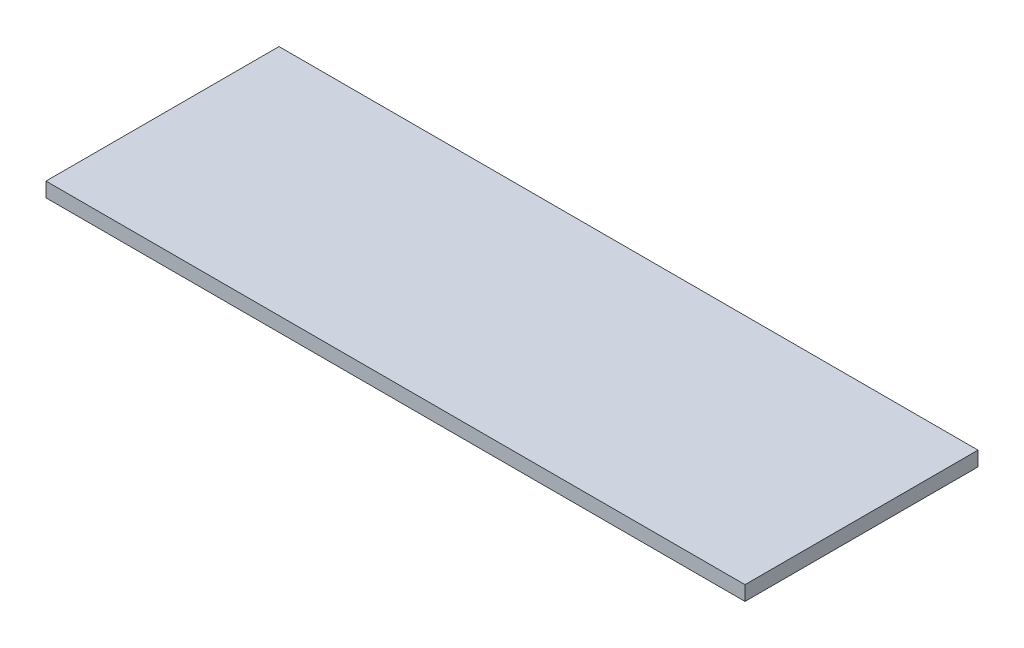
ISO-10303-21;
HEADER;
FILE_DESCRIPTION(('STEP AP214'),'2;1');
FILE_NAME('part.step','',(''),(''),'','','');
FILE_SCHEMA(('AUTOMOTIVE_DESIGN { 1 0 10303 214 1 1 1 1 }'));
ENDSEC;
DATA;
#1=APPLICATION_CONTEXT('core data for automotive mechanical design processes');
#2=APPLICATION_PROTOCOL_DEFINITION('international standard','automotive_design',2000,#1);
#3=PRODUCT_CONTEXT('',#1,'mechanical');
#4=PRODUCT('Part','Part','',(#3));
#5=PRODUCT_RELATED_PRODUCT_CATEGORY('part','',(#4));
#6=PRODUCT_DEFINITION_FORMATION('','',#4);
#7=PRODUCT_DEFINITION_CONTEXT('part definition',#1,'design');
#8=PRODUCT_DEFINITION('design','',#6,#7);
#9=PRODUCT_DEFINITION_SHAPE('','',#8);
#10=(LENGTH_UNIT() NAMED_UNIT(*) SI_UNIT(.MILLI.,.METRE.));
#11=(NAMED_UNIT(*) PLANE_ANGLE_UNIT() SI_UNIT($,.RADIAN.));
#12=(NAMED_UNIT(*) SI_UNIT($,.STERADIAN.) SOLID_ANGLE_UNIT());
#13=UNCERTAINTY_MEASURE_WITH_UNIT(LENGTH_MEASURE(1.E-05),#10,'distance_accuracy_value','');
#14=(GEOMETRIC_REPRESENTATION_CONTEXT(3) GLOBAL_UNCERTAINTY_ASSIGNED_CONTEXT((#13)) GLOBAL_UNIT_ASSIGNED_CONTEXT((#10,
#11,#12)) REPRESENTATION_CONTEXT('',''));
#15=CARTESIAN_POINT('',(0.,0.,0.));
#16=DIRECTION('',(0.,0.,1.));
#17=DIRECTION('',(1.,0.,0.));
#18=AXIS2_PLACEMENT_3D('',#15,#16,#17);
#19=CARTESIAN_POINT('',(0.,1.5875,0.));
#20=DIRECTION('',(1.,0.,0.));
#21=DIRECTION('',(0.,0.,-1.));
#22=AXIS2_PLACEMENT_3D('',#19,#20,#21);
#23=PLANE('',#22);
#24=DIRECTION('',(0.,0.,1.));
#25=VECTOR('',#24,1.);
#26=CARTESIAN_POINT('',(0.,0.,0.));
#27=LINE('',#26,#25);
#28=CARTESIAN_POINT('',(0.,0.,-25.4));
#29=VERTEX_POINT('',#28);
#30=CARTESIAN_POINT('',(0.,0.,0.));
#31=VERTEX_POINT('',#30);
#32=EDGE_CURVE('E96',#29,#31,#27,.T.);
#33=ORIENTED_EDGE('',*,*,#32,.T.);
#34=DIRECTION('',(0.,-1.,0.));
#35=VECTOR('',#34,1.);
#36=CARTESIAN_POINT('',(0.,1.5875,0.));
#37=LINE('',#36,#35);
#38=CARTESIAN_POINT('',(0.,1.5875,0.));
#39=VERTEX_POINT('',#38);
#40=EDGE_CURVE('E11',#39,#31,#37,.T.);
#41=ORIENTED_EDGE('',*,*,#40,.F.);
#42=DIRECTION('',(0.,0.,1.));
#43=VECTOR('',#42,1.);
#44=CARTESIAN_POINT('',(0.,1.5875,0.));
#45=LINE('',#44,#43);
#46=CARTESIAN_POINT('',(0.,1.5875,-25.4));
#47=VERTEX_POINT('',#46);
#48=EDGE_CURVE('E84',#47,#39,#45,.T.);
#49=ORIENTED_EDGE('',*,*,#48,.F.);
#50=DIRECTION('',(0.,-1.,0.));
#51=VECTOR('',#50,1.);
#52=CARTESIAN_POINT('',(0.,1.5875,-25.4));
#53=LINE('',#52,#51);
#54=EDGE_CURVE('E92',#47,#29,#53,.T.);
#55=ORIENTED_EDGE('',*,*,#54,.T.);
#56=EDGE_LOOP('',(#33,#41,#49,#55));
#57=FACE_BOUND('',#56,.T.);
#58=ADVANCED_FACE('F33',(#57),#23,.F.);
#59=CARTESIAN_POINT('',(0.,1.5875,0.));
#60=DIRECTION('',(0.,0.,-1.));
#61=DIRECTION('',(-1.,0.,0.));
#62=AXIS2_PLACEMENT_3D('',#59,#60,#61);
#63=PLANE('',#62);
#64=DIRECTION('',(1.,0.,0.));
#65=VECTOR('',#64,1.);
#66=CARTESIAN_POINT('',(0.,0.,0.));
#67=LINE('',#66,#65);
#68=CARTESIAN_POINT('',(76.2,0.,0.));
#69=VERTEX_POINT('',#68);
#70=EDGE_CURVE('E88',#31,#69,#67,.T.);
#71=ORIENTED_EDGE('',*,*,#70,.T.);
#72=DIRECTION('',(0.,-1.,0.));
#73=VECTOR('',#72,1.);
#74=CARTESIAN_POINT('',(76.2,1.5875,0.));
#75=LINE('',#74,#73);
#76=CARTESIAN_POINT('',(76.2,1.5875,0.));
#77=VERTEX_POINT('',#76);
#78=EDGE_CURVE('E41',#77,#69,#75,.T.);
#79=ORIENTED_EDGE('',*,*,#78,.F.);
#80=DIRECTION('',(1.,0.,0.));
#81=VECTOR('',#80,1.);
#82=CARTESIAN_POINT('',(0.,1.5875,0.));
#83=LINE('',#82,#81);
#84=EDGE_CURVE('E79',#39,#77,#83,.T.);
#85=ORIENTED_EDGE('',*,*,#84,.F.);
#86=ORIENTED_EDGE('',*,*,#40,.T.);
#87=EDGE_LOOP('',(#71,#79,#85,#86));
#88=FACE_BOUND('',#87,.T.);
#89=ADVANCED_FACE('F87',(#88),#63,.F.);
#90=CARTESIAN_POINT('',(76.2,1.5875,0.));
#91=DIRECTION('',(-1.,0.,0.));
#92=DIRECTION('',(0.,0.,1.));
#93=AXIS2_PLACEMENT_3D('',#90,#91,#92);
#94=PLANE('',#93);
#95=DIRECTION('',(0.,0.,-1.));
#96=VECTOR('',#95,1.);
#97=CARTESIAN_POINT('',(76.2,0.,0.));
#98=LINE('',#97,#96);
#99=CARTESIAN_POINT('',(76.2,0.,-25.4));
#100=VERTEX_POINT('',#99);
#101=EDGE_CURVE('E66',#69,#100,#98,.T.);
#102=ORIENTED_EDGE('',*,*,#101,.T.);
#103=DIRECTION('',(0.,-1.,0.));
#104=VECTOR('',#103,1.);
#105=CARTESIAN_POINT('',(76.2,1.5875,-25.4));
#106=LINE('',#105,#104);
#107=CARTESIAN_POINT('',(76.2,1.5875,-25.4));
#108=VERTEX_POINT('',#107);
#109=EDGE_CURVE('E89',#108,#100,#106,.T.);
#110=ORIENTED_EDGE('',*,*,#109,.F.);
#111=DIRECTION('',(0.,0.,-1.));
#112=VECTOR('',#111,1.);
#113=CARTESIAN_POINT('',(76.2,1.5875,0.));
#114=LINE('',#113,#112);
#115=EDGE_CURVE('E82',#77,#108,#114,.T.);
#116=ORIENTED_EDGE('',*,*,#115,.F.);
#117=ORIENTED_EDGE('',*,*,#78,.T.);
#118=EDGE_LOOP('',(#102,#110,#116,#117));
#119=FACE_BOUND('',#118,.T.);
#120=ADVANCED_FACE('F90',(#119),#94,.F.);
#121=CARTESIAN_POINT('',(0.,1.5875,-25.4));
#122=DIRECTION('',(0.,0.,1.));
#123=DIRECTION('',(1.,0.,0.));
#124=AXIS2_PLACEMENT_3D('',#121,#122,#123);
#125=PLANE('',#124);
#126=DIRECTION('',(-1.,0.,0.));
#127=VECTOR('',#126,1.);
#128=CARTESIAN_POINT('',(0.,0.,-25.4));
#129=LINE('',#128,#127);
#130=EDGE_CURVE('E72',#100,#29,#129,.T.);
#131=ORIENTED_EDGE('',*,*,#130,.T.);
#132=ORIENTED_EDGE('',*,*,#54,.F.);
#133=DIRECTION('',(-1.,0.,0.));
#134=VECTOR('',#133,1.);
#135=CARTESIAN_POINT('',(0.,1.5875,-25.4));
#136=LINE('',#135,#134);
#137=EDGE_CURVE('E49',#108,#47,#136,.T.);
#138=ORIENTED_EDGE('',*,*,#137,.F.);
#139=ORIENTED_EDGE('',*,*,#109,.T.);
#140=EDGE_LOOP('',(#131,#132,#138,#139));
#141=FACE_BOUND('',#140,.T.);
#142=ADVANCED_FACE('F103',(#141),#125,.F.);
#143=CARTESIAN_POINT('',(0.,1.5875,0.));
#144=DIRECTION('',(0.,-1.,0.));
#145=DIRECTION('',(0.,0.,-1.));
#146=AXIS2_PLACEMENT_3D('',#143,#144,#145);
#147=PLANE('',#146);
#148=ORIENTED_EDGE('',*,*,#48,.T.);
#149=ORIENTED_EDGE('',*,*,#84,.T.);
#150=ORIENTED_EDGE('',*,*,#115,.T.);
#151=ORIENTED_EDGE('',*,*,#137,.T.);
#152=EDGE_LOOP('',(#148,#149,#150,#151));
#153=FACE_BOUND('',#152,.T.);
#154=ADVANCED_FACE('F80',(#153),#147,.F.);
#155=CARTESIAN_POINT('',(0.,0.,0.));
#156=DIRECTION('',(0.,-1.,0.));
#157=DIRECTION('',(0.,0.,-1.));
#158=AXIS2_PLACEMENT_3D('',#155,#156,#157);
#159=PLANE('',#158);
#160=ORIENTED_EDGE('',*,*,#32,.F.);
#161=ORIENTED_EDGE('',*,*,#130,.F.);
#162=ORIENTED_EDGE('',*,*,#101,.F.);
#163=ORIENTED_EDGE('',*,*,#70,.F.);
#164=EDGE_LOOP('',(#160,#161,#162,#163));
#165=FACE_BOUND('',#164,.T.);
#166=ADVANCED_FACE('F106',(#165),#159,.T.);
#167=CLOSED_SHELL('',(#58,#89,#120,#142,#154,#166));
#168=MANIFOLD_SOLID_BREP('B2',#167);
#169=ADVANCED_BREP_SHAPE_REPRESENTATION('',(#18,#168),#14);
#170=SHAPE_DEFINITION_REPRESENTATION(#9,#169);
ENDSEC;
END-ISO-10303-21;
